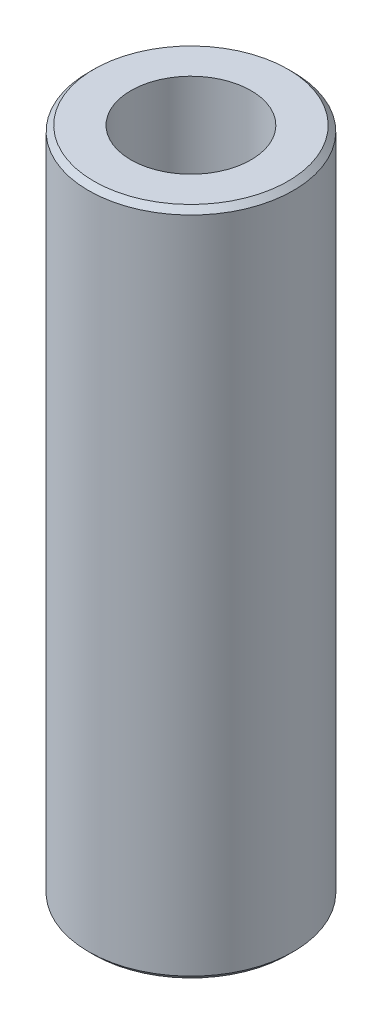
ISO-10303-21;
HEADER;
FILE_DESCRIPTION(('STEP AP214'),'2;1');
FILE_NAME('part.step','',(''),(''),'','','');
FILE_SCHEMA(('AUTOMOTIVE_DESIGN { 1 0 10303 214 1 1 1 1 }'));
ENDSEC;
DATA;
#1=APPLICATION_CONTEXT('core data for automotive mechanical design processes');
#2=APPLICATION_PROTOCOL_DEFINITION('international standard','automotive_design',2000,#1);
#3=PRODUCT_CONTEXT('',#1,'mechanical');
#4=PRODUCT('Part','Part','',(#3));
#5=PRODUCT_RELATED_PRODUCT_CATEGORY('part','',(#4));
#6=PRODUCT_DEFINITION_FORMATION('','',#4);
#7=PRODUCT_DEFINITION_CONTEXT('part definition',#1,'design');
#8=PRODUCT_DEFINITION('design','',#6,#7);
#9=PRODUCT_DEFINITION_SHAPE('','',#8);
#10=(LENGTH_UNIT() NAMED_UNIT(*) SI_UNIT(.MILLI.,.METRE.));
#11=(NAMED_UNIT(*) PLANE_ANGLE_UNIT() SI_UNIT($,.RADIAN.));
#12=(NAMED_UNIT(*) SI_UNIT($,.STERADIAN.) SOLID_ANGLE_UNIT());
#13=UNCERTAINTY_MEASURE_WITH_UNIT(LENGTH_MEASURE(1.E-05),#10,'distance_accuracy_value','');
#14=(GEOMETRIC_REPRESENTATION_CONTEXT(3) GLOBAL_UNCERTAINTY_ASSIGNED_CONTEXT((#13)) GLOBAL_UNIT_ASSIGNED_CONTEXT((#10,
#11,#12)) REPRESENTATION_CONTEXT('',''));
#15=CARTESIAN_POINT('',(0.,0.,0.));
#16=DIRECTION('',(0.,0.,1.));
#17=DIRECTION('',(1.,0.,0.));
#18=AXIS2_PLACEMENT_3D('',#15,#16,#17);
#19=CARTESIAN_POINT('',(0.,294.29726974671,0.));
#20=DIRECTION('',(0.,-1.,0.));
#21=DIRECTION('',(0.,0.,-1.));
#22=AXIS2_PLACEMENT_3D('',#19,#20,#21);
#23=CYLINDRICAL_SURFACE('',#22,45.);
#24=CARTESIAN_POINT('',(0.,291.934728250522,0.));
#25=DIRECTION('',(0.,1.,0.));
#26=DIRECTION('',(0.,0.,1.));
#27=AXIS2_PLACEMENT_3D('',#24,#25,#26);
#28=CIRCLE('',#27,45.);
#29=CARTESIAN_POINT('',(0.,291.934728250522,45.));
#30=VERTEX_POINT('',#29);
#31=EDGE_CURVE('E50',#30,#30,#28,.F.);
#32=ORIENTED_EDGE('',*,*,#31,.T.);
#33=EDGE_LOOP('',(#32));
#34=FACE_BOUND('',#33,.T.);
#35=CARTESIAN_POINT('',(0.,2.36254149618775,0.));
#36=DIRECTION('',(0.,1.,0.));
#37=DIRECTION('',(0.,0.,1.));
#38=AXIS2_PLACEMENT_3D('',#35,#36,#37);
#39=CIRCLE('',#38,45.);
#40=CARTESIAN_POINT('',(0.,2.36254149618775,45.));
#41=VERTEX_POINT('',#40);
#42=EDGE_CURVE('E51',#41,#41,#39,.T.);
#43=ORIENTED_EDGE('',*,*,#42,.T.);
#44=EDGE_LOOP('',(#43));
#45=FACE_BOUND('',#44,.T.);
#46=ADVANCED_FACE('F39',(#34,#45),#23,.T.);
#47=CARTESIAN_POINT('',(0.,294.29726974671,0.));
#48=DIRECTION('',(0.,1.,0.));
#49=DIRECTION('',(0.,0.,1.));
#50=AXIS2_PLACEMENT_3D('',#47,#48,#49);
#51=PLANE('',#50);
#52=CARTESIAN_POINT('',(0.,294.29726974671,0.));
#53=DIRECTION('',(0.,1.,0.));
#54=DIRECTION('',(0.,0.,1.));
#55=AXIS2_PLACEMENT_3D('',#52,#53,#54);
#56=CIRCLE('',#55,42.6374585038123);
#57=CARTESIAN_POINT('',(0.,294.29726974671,42.6374585038123));
#58=VERTEX_POINT('',#57);
#59=EDGE_CURVE('E54',#58,#58,#56,.T.);
#60=ORIENTED_EDGE('',*,*,#59,.T.);
#61=EDGE_LOOP('',(#60));
#62=FACE_BOUND('',#61,.T.);
#63=CARTESIAN_POINT('',(0.,294.29726974671,0.));
#64=DIRECTION('',(0.,1.,0.));
#65=DIRECTION('',(0.,0.,1.));
#66=AXIS2_PLACEMENT_3D('',#63,#64,#65);
#67=CIRCLE('',#66,26.3868993098511);
#68=CARTESIAN_POINT('',(0.,294.29726974671,26.3868993098511));
#69=VERTEX_POINT('',#68);
#70=EDGE_CURVE('E58',#69,#69,#67,.T.);
#71=ORIENTED_EDGE('',*,*,#70,.F.);
#72=EDGE_LOOP('',(#71));
#73=FACE_BOUND('',#72,.T.);
#74=ADVANCED_FACE('F69',(#62,#73),#51,.T.);
#75=CARTESIAN_POINT('',(0.,0.,0.));
#76=DIRECTION('',(0.,1.,0.));
#77=DIRECTION('',(0.,0.,1.));
#78=AXIS2_PLACEMENT_3D('',#75,#76,#77);
#79=PLANE('',#78);
#80=CARTESIAN_POINT('',(0.,0.,0.));
#81=DIRECTION('',(0.,1.,0.));
#82=DIRECTION('',(0.,0.,1.));
#83=AXIS2_PLACEMENT_3D('',#80,#81,#82);
#84=CIRCLE('',#83,42.6374585038123);
#85=CARTESIAN_POINT('',(0.,0.,42.6374585038123));
#86=VERTEX_POINT('',#85);
#87=EDGE_CURVE('E10',#86,#86,#84,.F.);
#88=ORIENTED_EDGE('',*,*,#87,.T.);
#89=EDGE_LOOP('',(#88));
#90=FACE_BOUND('',#89,.T.);
#91=CARTESIAN_POINT('',(0.,0.,0.));
#92=DIRECTION('',(0.,1.,0.));
#93=DIRECTION('',(0.,0.,1.));
#94=AXIS2_PLACEMENT_3D('',#91,#92,#93);
#95=CIRCLE('',#94,26.3868993098511);
#96=CARTESIAN_POINT('',(0.,0.,26.3868993098511));
#97=VERTEX_POINT('',#96);
#98=EDGE_CURVE('E63',#97,#97,#95,.T.);
#99=ORIENTED_EDGE('',*,*,#98,.T.);
#100=EDGE_LOOP('',(#99));
#101=FACE_BOUND('',#100,.T.);
#102=ADVANCED_FACE('F75',(#90,#101),#79,.F.);
#103=CARTESIAN_POINT('',(0.,294.29726974671,0.));
#104=DIRECTION('',(0.,-1.,0.));
#105=DIRECTION('',(0.,0.,-1.));
#106=AXIS2_PLACEMENT_3D('',#103,#104,#105);
#107=CYLINDRICAL_SURFACE('',#106,26.3868993098511);
#108=ORIENTED_EDGE('',*,*,#70,.T.);
#109=EDGE_LOOP('',(#108));
#110=FACE_BOUND('',#109,.T.);
#111=ORIENTED_EDGE('',*,*,#98,.F.);
#112=EDGE_LOOP('',(#111));
#113=FACE_BOUND('',#112,.T.);
#114=ADVANCED_FACE('F70',(#110,#113),#107,.F.);
#115=CARTESIAN_POINT('',(0.,294.29726974671,0.));
#116=DIRECTION('',(0.,-1.,0.));
#117=DIRECTION('',(0.,0.,-1.));
#118=AXIS2_PLACEMENT_3D('',#115,#116,#117);
#119=CONICAL_SURFACE('',#118,42.6374585038123,0.785398163397453);
#120=ORIENTED_EDGE('',*,*,#31,.F.);
#121=EDGE_LOOP('',(#120));
#122=FACE_BOUND('',#121,.T.);
#123=ORIENTED_EDGE('',*,*,#59,.F.);
#124=EDGE_LOOP('',(#123));
#125=FACE_BOUND('',#124,.T.);
#126=ADVANCED_FACE('F81',(#122,#125),#119,.T.);
#127=CARTESIAN_POINT('',(0.,2.36254149618775,0.));
#128=DIRECTION('',(0.,1.,0.));
#129=DIRECTION('',(0.,0.,1.));
#130=AXIS2_PLACEMENT_3D('',#127,#128,#129);
#131=CONICAL_SURFACE('',#130,45.,0.785398163397448);
#132=ORIENTED_EDGE('',*,*,#87,.F.);
#133=EDGE_LOOP('',(#132));
#134=FACE_BOUND('',#133,.T.);
#135=ORIENTED_EDGE('',*,*,#42,.F.);
#136=EDGE_LOOP('',(#135));
#137=FACE_BOUND('',#136,.T.);
#138=ADVANCED_FACE('F45',(#134,#137),#131,.T.);
#139=CLOSED_SHELL('',(#46,#74,#102,#114,#126,#138));
#140=MANIFOLD_SOLID_BREP('B2',#139);
#141=ADVANCED_BREP_SHAPE_REPRESENTATION('',(#18,#140),#14);
#142=SHAPE_DEFINITION_REPRESENTATION(#9,#141);
ENDSEC;
END-ISO-10303-21;
